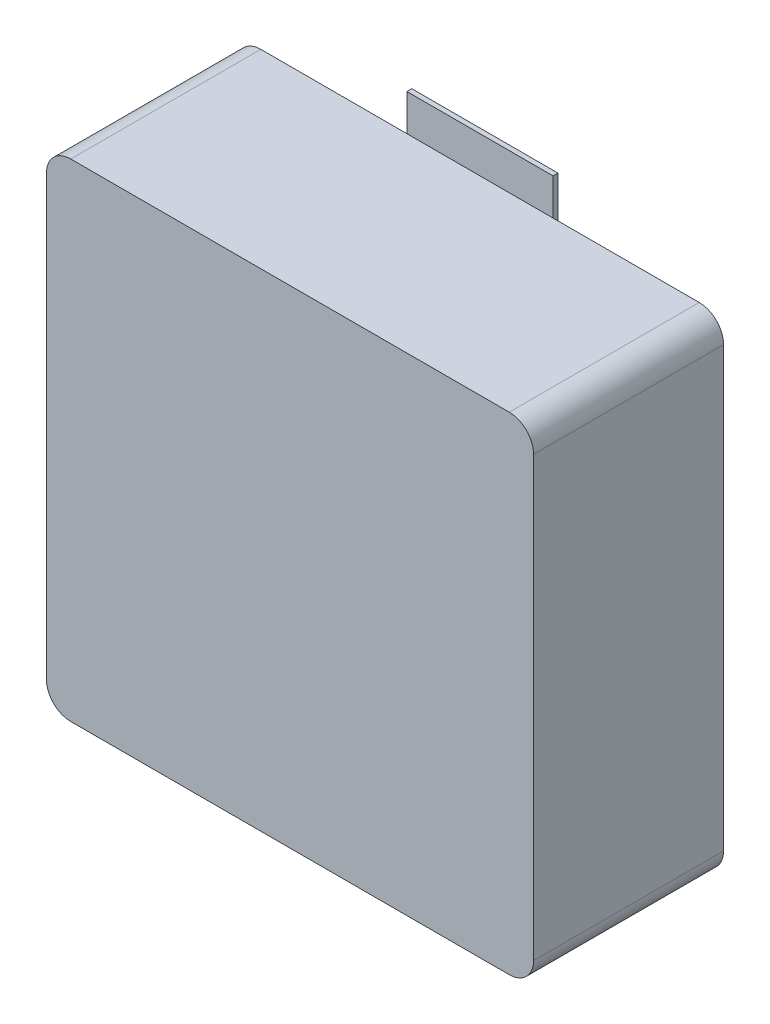
ISO-10303-21;
HEADER;
FILE_DESCRIPTION(('STEP AP214'),'2;1');
FILE_NAME('part.step','',(''),(''),'','','');
FILE_SCHEMA(('AUTOMOTIVE_DESIGN { 1 0 10303 214 1 1 1 1 }'));
ENDSEC;
DATA;
#1=APPLICATION_CONTEXT('core data for automotive mechanical design processes');
#2=APPLICATION_PROTOCOL_DEFINITION('international standard','automotive_design',2000,#1);
#3=PRODUCT_CONTEXT('',#1,'mechanical');
#4=PRODUCT('Part','Part','',(#3));
#5=PRODUCT_RELATED_PRODUCT_CATEGORY('part','',(#4));
#6=PRODUCT_DEFINITION_FORMATION('','',#4);
#7=PRODUCT_DEFINITION_CONTEXT('part definition',#1,'design');
#8=PRODUCT_DEFINITION('design','',#6,#7);
#9=PRODUCT_DEFINITION_SHAPE('','',#8);
#10=(LENGTH_UNIT() NAMED_UNIT(*) SI_UNIT(.MILLI.,.METRE.));
#11=(NAMED_UNIT(*) PLANE_ANGLE_UNIT() SI_UNIT($,.RADIAN.));
#12=(NAMED_UNIT(*) SI_UNIT($,.STERADIAN.) SOLID_ANGLE_UNIT());
#13=UNCERTAINTY_MEASURE_WITH_UNIT(LENGTH_MEASURE(1.E-05),#10,'distance_accuracy_value','');
#14=(GEOMETRIC_REPRESENTATION_CONTEXT(3) GLOBAL_UNCERTAINTY_ASSIGNED_CONTEXT((#13)) GLOBAL_UNIT_ASSIGNED_CONTEXT((#10,
#11,#12)) REPRESENTATION_CONTEXT('',''));
#15=CARTESIAN_POINT('',(0.,0.,0.));
#16=DIRECTION('',(0.,0.,1.));
#17=DIRECTION('',(1.,0.,0.));
#18=AXIS2_PLACEMENT_3D('',#15,#16,#17);
#19=CARTESIAN_POINT('',(0.,0.,0.));
#20=DIRECTION('',(0.,0.,-1.));
#21=DIRECTION('',(0.,-1.,0.));
#22=AXIS2_PLACEMENT_3D('',#19,#20,#21);
#23=PLANE('',#22);
#24=DIRECTION('',(-1.,0.,0.));
#25=VECTOR('',#24,1.);
#26=CARTESIAN_POINT('',(0.,5.,0.));
#27=LINE('',#26,#25);
#28=CARTESIAN_POINT('',(1.5,5.,0.));
#29=VERTEX_POINT('',#28);
#30=CARTESIAN_POINT('',(-1.5,5.,0.));
#31=VERTEX_POINT('',#30);
#32=EDGE_CURVE('E202',#29,#31,#27,.T.);
#33=ORIENTED_EDGE('',*,*,#32,.F.);
#34=DIRECTION('',(0.,-1.,0.));
#35=VECTOR('',#34,1.);
#36=CARTESIAN_POINT('',(1.5,4.75,0.));
#37=LINE('',#36,#35);
#38=CARTESIAN_POINT('',(1.5,5.75,0.));
#39=VERTEX_POINT('',#38);
#40=EDGE_CURVE('E391',#39,#29,#37,.T.);
#41=ORIENTED_EDGE('',*,*,#40,.F.);
#42=DIRECTION('',(-1.,0.,0.));
#43=VECTOR('',#42,1.);
#44=CARTESIAN_POINT('',(0.,5.75,0.));
#45=LINE('',#44,#43);
#46=CARTESIAN_POINT('',(-1.5,5.75,0.));
#47=VERTEX_POINT('',#46);
#48=EDGE_CURVE('E205',#39,#47,#45,.T.);
#49=ORIENTED_EDGE('',*,*,#48,.T.);
#50=DIRECTION('',(0.,-1.,0.));
#51=VECTOR('',#50,1.);
#52=CARTESIAN_POINT('',(-1.5,4.75,0.));
#53=LINE('',#52,#51);
#54=EDGE_CURVE('E28',#47,#31,#53,.T.);
#55=ORIENTED_EDGE('',*,*,#54,.T.);
#56=EDGE_LOOP('',(#33,#41,#49,#55));
#57=FACE_BOUND('',#56,.T.);
#58=ADVANCED_FACE('F17',(#57),#23,.F.);
#59=CARTESIAN_POINT('',(0.,0.,-0.1));
#60=DIRECTION('',(0.,0.,-1.));
#61=DIRECTION('',(0.,-1.,0.));
#62=AXIS2_PLACEMENT_3D('',#59,#60,#61);
#63=PLANE('',#62);
#64=DIRECTION('',(-1.,0.,0.));
#65=VECTOR('',#64,1.);
#66=CARTESIAN_POINT('',(0.,5.75,-0.1));
#67=LINE('',#66,#65);
#68=CARTESIAN_POINT('',(1.5,5.75,-0.1));
#69=VERTEX_POINT('',#68);
#70=CARTESIAN_POINT('',(-1.5,5.75,-0.1));
#71=VERTEX_POINT('',#70);
#72=EDGE_CURVE('E286',#69,#71,#67,.T.);
#73=ORIENTED_EDGE('',*,*,#72,.F.);
#74=DIRECTION('',(0.,-1.,0.));
#75=VECTOR('',#74,1.);
#76=CARTESIAN_POINT('',(1.5,4.75,-0.1));
#77=LINE('',#76,#75);
#78=CARTESIAN_POINT('',(1.5,3.75,-0.1));
#79=VERTEX_POINT('',#78);
#80=EDGE_CURVE('E309',#69,#79,#77,.T.);
#81=ORIENTED_EDGE('',*,*,#80,.T.);
#82=DIRECTION('',(-1.,0.,0.));
#83=VECTOR('',#82,1.);
#84=CARTESIAN_POINT('',(0.,3.75,-0.1));
#85=LINE('',#84,#83);
#86=CARTESIAN_POINT('',(-1.5,3.75,-0.1));
#87=VERTEX_POINT('',#86);
#88=EDGE_CURVE('E21',#79,#87,#85,.T.);
#89=ORIENTED_EDGE('',*,*,#88,.T.);
#90=DIRECTION('',(0.,-1.,0.));
#91=VECTOR('',#90,1.);
#92=CARTESIAN_POINT('',(-1.5,4.75,-0.1));
#93=LINE('',#92,#91);
#94=EDGE_CURVE('E11',#71,#87,#93,.T.);
#95=ORIENTED_EDGE('',*,*,#94,.F.);
#96=EDGE_LOOP('',(#73,#81,#89,#95));
#97=FACE_BOUND('',#96,.T.);
#98=ADVANCED_FACE('F454',(#97),#63,.T.);
#99=CARTESIAN_POINT('',(-1.5,4.75,-0.1));
#100=DIRECTION('',(-1.,0.,0.));
#101=DIRECTION('',(0.,1.,0.));
#102=AXIS2_PLACEMENT_3D('',#99,#100,#101);
#103=PLANE('',#102);
#104=ORIENTED_EDGE('',*,*,#54,.F.);
#105=DIRECTION('',(0.,0.,1.));
#106=VECTOR('',#105,1.);
#107=CARTESIAN_POINT('',(-1.5,5.75,-0.1));
#108=LINE('',#107,#106);
#109=EDGE_CURVE('E289',#71,#47,#108,.T.);
#110=ORIENTED_EDGE('',*,*,#109,.F.);
#111=ORIENTED_EDGE('',*,*,#94,.T.);
#112=DIRECTION('',(0.,0.,1.));
#113=VECTOR('',#112,1.);
#114=CARTESIAN_POINT('',(-1.5,3.75,-0.1));
#115=LINE('',#114,#113);
#116=CARTESIAN_POINT('',(-1.5,3.75,0.));
#117=VERTEX_POINT('',#116);
#118=EDGE_CURVE('E214',#87,#117,#115,.T.);
#119=ORIENTED_EDGE('',*,*,#118,.T.);
#120=DIRECTION('',(0.,-1.,0.));
#121=VECTOR('',#120,1.);
#122=CARTESIAN_POINT('',(-1.5,4.75,0.));
#123=LINE('',#122,#121);
#124=EDGE_CURVE('E210',#31,#117,#123,.T.);
#125=ORIENTED_EDGE('',*,*,#124,.F.);
#126=EDGE_LOOP('',(#104,#110,#111,#119,#125));
#127=FACE_BOUND('',#126,.T.);
#128=ADVANCED_FACE('F212',(#127),#103,.T.);
#129=CARTESIAN_POINT('',(0.,3.75,-0.1));
#130=DIRECTION('',(0.,1.,0.));
#131=DIRECTION('',(1.,0.,0.));
#132=AXIS2_PLACEMENT_3D('',#129,#130,#131);
#133=PLANE('',#132);
#134=DIRECTION('',(-1.,0.,0.));
#135=VECTOR('',#134,1.);
#136=CARTESIAN_POINT('',(0.,3.75,0.));
#137=LINE('',#136,#135);
#138=CARTESIAN_POINT('',(1.5,3.75,0.));
#139=VERTEX_POINT('',#138);
#140=EDGE_CURVE('E219',#139,#117,#137,.T.);
#141=ORIENTED_EDGE('',*,*,#140,.T.);
#142=ORIENTED_EDGE('',*,*,#118,.F.);
#143=ORIENTED_EDGE('',*,*,#88,.F.);
#144=DIRECTION('',(0.,0.,1.));
#145=VECTOR('',#144,1.);
#146=CARTESIAN_POINT('',(1.5,3.75,-0.1));
#147=LINE('',#146,#145);
#148=EDGE_CURVE('E313',#79,#139,#147,.T.);
#149=ORIENTED_EDGE('',*,*,#148,.T.);
#150=EDGE_LOOP('',(#141,#142,#143,#149));
#151=FACE_BOUND('',#150,.T.);
#152=ADVANCED_FACE('F457',(#151),#133,.F.);
#153=CARTESIAN_POINT('',(1.5,4.75,-0.1));
#154=DIRECTION('',(-1.,0.,0.));
#155=DIRECTION('',(0.,1.,0.));
#156=AXIS2_PLACEMENT_3D('',#153,#154,#155);
#157=PLANE('',#156);
#158=ORIENTED_EDGE('',*,*,#40,.T.);
#159=DIRECTION('',(0.,-1.,0.));
#160=VECTOR('',#159,1.);
#161=CARTESIAN_POINT('',(1.5,4.75,0.));
#162=LINE('',#161,#160);
#163=EDGE_CURVE('E373',#29,#139,#162,.T.);
#164=ORIENTED_EDGE('',*,*,#163,.T.);
#165=ORIENTED_EDGE('',*,*,#148,.F.);
#166=ORIENTED_EDGE('',*,*,#80,.F.);
#167=DIRECTION('',(0.,0.,1.));
#168=VECTOR('',#167,1.);
#169=CARTESIAN_POINT('',(1.5,5.75,-0.1));
#170=LINE('',#169,#168);
#171=EDGE_CURVE('E277',#69,#39,#170,.T.);
#172=ORIENTED_EDGE('',*,*,#171,.T.);
#173=EDGE_LOOP('',(#158,#164,#165,#166,#172));
#174=FACE_BOUND('',#173,.T.);
#175=ADVANCED_FACE('F465',(#174),#157,.F.);
#176=CARTESIAN_POINT('',(0.,5.75,-0.1));
#177=DIRECTION('',(0.,1.,0.));
#178=DIRECTION('',(1.,0.,0.));
#179=AXIS2_PLACEMENT_3D('',#176,#177,#178);
#180=PLANE('',#179);
#181=ORIENTED_EDGE('',*,*,#48,.F.);
#182=ORIENTED_EDGE('',*,*,#171,.F.);
#183=ORIENTED_EDGE('',*,*,#72,.T.);
#184=ORIENTED_EDGE('',*,*,#109,.T.);
#185=EDGE_LOOP('',(#181,#182,#183,#184));
#186=FACE_BOUND('',#185,.T.);
#187=ADVANCED_FACE('F449',(#186),#180,.T.);
#188=CARTESIAN_POINT('',(0.,0.,-0.1));
#189=DIRECTION('',(0.,0.,-1.));
#190=DIRECTION('',(0.,-1.,0.));
#191=AXIS2_PLACEMENT_3D('',#188,#189,#190);
#192=PLANE('',#191);
#193=DIRECTION('',(-1.,0.,0.));
#194=VECTOR('',#193,1.);
#195=CARTESIAN_POINT('',(0.,-3.75,-0.1));
#196=LINE('',#195,#194);
#197=CARTESIAN_POINT('',(1.5,-3.75,-0.1));
#198=VERTEX_POINT('',#197);
#199=CARTESIAN_POINT('',(-1.5,-3.75,-0.1));
#200=VERTEX_POINT('',#199);
#201=EDGE_CURVE('E255',#198,#200,#196,.T.);
#202=ORIENTED_EDGE('',*,*,#201,.F.);
#203=DIRECTION('',(0.,-1.,0.));
#204=VECTOR('',#203,1.);
#205=CARTESIAN_POINT('',(1.5,-4.75,-0.1));
#206=LINE('',#205,#204);
#207=CARTESIAN_POINT('',(1.5,-5.75,-0.1));
#208=VERTEX_POINT('',#207);
#209=EDGE_CURVE('E264',#198,#208,#206,.T.);
#210=ORIENTED_EDGE('',*,*,#209,.T.);
#211=DIRECTION('',(-1.,0.,0.));
#212=VECTOR('',#211,1.);
#213=CARTESIAN_POINT('',(0.,-5.75,-0.1));
#214=LINE('',#213,#212);
#215=CARTESIAN_POINT('',(-1.5,-5.75,-0.1));
#216=VERTEX_POINT('',#215);
#217=EDGE_CURVE('E352',#208,#216,#214,.T.);
#218=ORIENTED_EDGE('',*,*,#217,.T.);
#219=DIRECTION('',(0.,-1.,0.));
#220=VECTOR('',#219,1.);
#221=CARTESIAN_POINT('',(-1.5,-4.75,-0.1));
#222=LINE('',#221,#220);
#223=EDGE_CURVE('E357',#200,#216,#222,.T.);
#224=ORIENTED_EDGE('',*,*,#223,.F.);
#225=EDGE_LOOP('',(#202,#210,#218,#224));
#226=FACE_BOUND('',#225,.T.);
#227=ADVANCED_FACE('F475',(#226),#192,.T.);
#228=CARTESIAN_POINT('',(-1.5,-4.75,-0.1));
#229=DIRECTION('',(-1.,0.,0.));
#230=DIRECTION('',(0.,0.,1.));
#231=AXIS2_PLACEMENT_3D('',#228,#229,#230);
#232=PLANE('',#231);
#233=DIRECTION('',(0.,-1.,0.));
#234=VECTOR('',#233,1.);
#235=CARTESIAN_POINT('',(-1.5,-4.75,0.));
#236=LINE('',#235,#234);
#237=CARTESIAN_POINT('',(-1.5,-3.75,0.));
#238=VERTEX_POINT('',#237);
#239=CARTESIAN_POINT('',(-1.5,-5.,0.));
#240=VERTEX_POINT('',#239);
#241=EDGE_CURVE('E220',#238,#240,#236,.T.);
#242=ORIENTED_EDGE('',*,*,#241,.F.);
#243=DIRECTION('',(0.,0.,1.));
#244=VECTOR('',#243,1.);
#245=CARTESIAN_POINT('',(-1.5,-3.75,-0.1));
#246=LINE('',#245,#244);
#247=EDGE_CURVE('E253',#200,#238,#246,.T.);
#248=ORIENTED_EDGE('',*,*,#247,.F.);
#249=ORIENTED_EDGE('',*,*,#223,.T.);
#250=DIRECTION('',(0.,0.,1.));
#251=VECTOR('',#250,1.);
#252=CARTESIAN_POINT('',(-1.5,-5.75,-0.1));
#253=LINE('',#252,#251);
#254=CARTESIAN_POINT('',(-1.5,-5.75,0.));
#255=VERTEX_POINT('',#254);
#256=EDGE_CURVE('E189',#216,#255,#253,.T.);
#257=ORIENTED_EDGE('',*,*,#256,.T.);
#258=DIRECTION('',(0.,-1.,0.));
#259=VECTOR('',#258,1.);
#260=CARTESIAN_POINT('',(-1.5,-4.75,0.));
#261=LINE('',#260,#259);
#262=EDGE_CURVE('E328',#240,#255,#261,.T.);
#263=ORIENTED_EDGE('',*,*,#262,.F.);
#264=EDGE_LOOP('',(#242,#248,#249,#257,#263));
#265=FACE_BOUND('',#264,.T.);
#266=ADVANCED_FACE('F497',(#265),#232,.T.);
#267=CARTESIAN_POINT('',(0.,-5.75,-0.1));
#268=DIRECTION('',(0.,1.,0.));
#269=DIRECTION('',(1.,0.,0.));
#270=AXIS2_PLACEMENT_3D('',#267,#268,#269);
#271=PLANE('',#270);
#272=DIRECTION('',(-1.,0.,0.));
#273=VECTOR('',#272,1.);
#274=CARTESIAN_POINT('',(0.,-5.75,0.));
#275=LINE('',#274,#273);
#276=CARTESIAN_POINT('',(1.5,-5.75,0.));
#277=VERTEX_POINT('',#276);
#278=EDGE_CURVE('E274',#277,#255,#275,.T.);
#279=ORIENTED_EDGE('',*,*,#278,.T.);
#280=ORIENTED_EDGE('',*,*,#256,.F.);
#281=ORIENTED_EDGE('',*,*,#217,.F.);
#282=DIRECTION('',(0.,0.,1.));
#283=VECTOR('',#282,1.);
#284=CARTESIAN_POINT('',(1.5,-5.75,-0.1));
#285=LINE('',#284,#283);
#286=EDGE_CURVE('E179',#208,#277,#285,.T.);
#287=ORIENTED_EDGE('',*,*,#286,.T.);
#288=EDGE_LOOP('',(#279,#280,#281,#287));
#289=FACE_BOUND('',#288,.T.);
#290=ADVANCED_FACE('F496',(#289),#271,.F.);
#291=CARTESIAN_POINT('',(1.5,-4.75,-0.1));
#292=DIRECTION('',(-1.,0.,0.));
#293=DIRECTION('',(0.,0.,1.));
#294=AXIS2_PLACEMENT_3D('',#291,#292,#293);
#295=PLANE('',#294);
#296=DIRECTION('',(0.,-1.,0.));
#297=VECTOR('',#296,1.);
#298=CARTESIAN_POINT('',(1.5,-4.75,0.));
#299=LINE('',#298,#297);
#300=CARTESIAN_POINT('',(1.5,-3.75,0.));
#301=VERTEX_POINT('',#300);
#302=CARTESIAN_POINT('',(1.5,-5.,0.));
#303=VERTEX_POINT('',#302);
#304=EDGE_CURVE('E317',#301,#303,#299,.T.);
#305=ORIENTED_EDGE('',*,*,#304,.T.);
#306=DIRECTION('',(0.,-1.,0.));
#307=VECTOR('',#306,1.);
#308=CARTESIAN_POINT('',(1.5,-4.75,0.));
#309=LINE('',#308,#307);
#310=EDGE_CURVE('E331',#303,#277,#309,.T.);
#311=ORIENTED_EDGE('',*,*,#310,.T.);
#312=ORIENTED_EDGE('',*,*,#286,.F.);
#313=ORIENTED_EDGE('',*,*,#209,.F.);
#314=DIRECTION('',(0.,0.,1.));
#315=VECTOR('',#314,1.);
#316=CARTESIAN_POINT('',(1.5,-3.75,-0.1));
#317=LINE('',#316,#315);
#318=EDGE_CURVE('E267',#198,#301,#317,.T.);
#319=ORIENTED_EDGE('',*,*,#318,.T.);
#320=EDGE_LOOP('',(#305,#311,#312,#313,#319));
#321=FACE_BOUND('',#320,.T.);
#322=ADVANCED_FACE('F493',(#321),#295,.F.);
#323=CARTESIAN_POINT('',(0.,-3.75,-0.1));
#324=DIRECTION('',(0.,1.,0.));
#325=DIRECTION('',(1.,0.,0.));
#326=AXIS2_PLACEMENT_3D('',#323,#324,#325);
#327=PLANE('',#326);
#328=DIRECTION('',(-1.,0.,0.));
#329=VECTOR('',#328,1.);
#330=CARTESIAN_POINT('',(0.,-3.75,0.));
#331=LINE('',#330,#329);
#332=EDGE_CURVE('E306',#301,#238,#331,.T.);
#333=ORIENTED_EDGE('',*,*,#332,.F.);
#334=ORIENTED_EDGE('',*,*,#318,.F.);
#335=ORIENTED_EDGE('',*,*,#201,.T.);
#336=ORIENTED_EDGE('',*,*,#247,.T.);
#337=EDGE_LOOP('',(#333,#334,#335,#336));
#338=FACE_BOUND('',#337,.T.);
#339=ADVANCED_FACE('F495',(#338),#327,.T.);
#340=CARTESIAN_POINT('',(0.,0.,0.));
#341=DIRECTION('',(0.,0.,-1.));
#342=DIRECTION('',(0.,-1.,0.));
#343=AXIS2_PLACEMENT_3D('',#340,#341,#342);
#344=PLANE('',#343);
#345=ORIENTED_EDGE('',*,*,#310,.F.);
#346=DIRECTION('',(-1.,0.,0.));
#347=VECTOR('',#346,1.);
#348=CARTESIAN_POINT('',(0.,-5.,0.));
#349=LINE('',#348,#347);
#350=EDGE_CURVE('E247',#303,#240,#349,.T.);
#351=ORIENTED_EDGE('',*,*,#350,.T.);
#352=ORIENTED_EDGE('',*,*,#262,.T.);
#353=ORIENTED_EDGE('',*,*,#278,.F.);
#354=EDGE_LOOP('',(#345,#351,#352,#353));
#355=FACE_BOUND('',#354,.T.);
#356=ADVANCED_FACE('F19',(#355),#344,.F.);
#357=CARTESIAN_POINT('',(0.,0.,0.));
#358=DIRECTION('',(0.,0.,1.));
#359=DIRECTION('',(1.,0.,0.));
#360=AXIS2_PLACEMENT_3D('',#357,#358,#359);
#361=PLANE('',#360);
#362=DIRECTION('',(0.,1.,0.));
#363=VECTOR('',#362,1.);
#364=CARTESIAN_POINT('',(5.,0.,0.));
#365=LINE('',#364,#363);
#366=CARTESIAN_POINT('',(5.,-4.5,0.));
#367=VERTEX_POINT('',#366);
#368=CARTESIAN_POINT('',(5.,4.5,0.));
#369=VERTEX_POINT('',#368);
#370=EDGE_CURVE('E229',#367,#369,#365,.T.);
#371=ORIENTED_EDGE('',*,*,#370,.F.);
#372=CARTESIAN_POINT('',(4.5,-4.5,0.));
#373=DIRECTION('',(0.,0.,-1.));
#374=DIRECTION('',(1.,0.,0.));
#375=AXIS2_PLACEMENT_3D('',#372,#373,#374);
#376=CIRCLE('',#375,0.5);
#377=CARTESIAN_POINT('',(4.5,-5.,0.));
#378=VERTEX_POINT('',#377);
#379=EDGE_CURVE('E284',#367,#378,#376,.T.);
#380=ORIENTED_EDGE('',*,*,#379,.T.);
#381=DIRECTION('',(-1.,0.,0.));
#382=VECTOR('',#381,1.);
#383=CARTESIAN_POINT('',(0.,-5.,0.));
#384=LINE('',#383,#382);
#385=EDGE_CURVE('E295',#378,#303,#384,.T.);
#386=ORIENTED_EDGE('',*,*,#385,.T.);
#387=ORIENTED_EDGE('',*,*,#304,.F.);
#388=ORIENTED_EDGE('',*,*,#332,.T.);
#389=ORIENTED_EDGE('',*,*,#241,.T.);
#390=DIRECTION('',(-1.,0.,0.));
#391=VECTOR('',#390,1.);
#392=CARTESIAN_POINT('',(0.,-5.,0.));
#393=LINE('',#392,#391);
#394=CARTESIAN_POINT('',(-4.5,-5.,0.));
#395=VERTEX_POINT('',#394);
#396=EDGE_CURVE('E245',#240,#395,#393,.T.);
#397=ORIENTED_EDGE('',*,*,#396,.T.);
#398=CARTESIAN_POINT('',(-4.5,-4.5,0.));
#399=DIRECTION('',(0.,0.,-1.));
#400=DIRECTION('',(1.,0.,0.));
#401=AXIS2_PLACEMENT_3D('',#398,#399,#400);
#402=CIRCLE('',#401,0.5);
#403=CARTESIAN_POINT('',(-5.,-4.5,0.));
#404=VERTEX_POINT('',#403);
#405=EDGE_CURVE('E249',#395,#404,#402,.T.);
#406=ORIENTED_EDGE('',*,*,#405,.T.);
#407=DIRECTION('',(0.,1.,0.));
#408=VECTOR('',#407,1.);
#409=CARTESIAN_POINT('',(-5.,0.,0.));
#410=LINE('',#409,#408);
#411=CARTESIAN_POINT('',(-5.,4.5,0.));
#412=VERTEX_POINT('',#411);
#413=EDGE_CURVE('E314',#404,#412,#410,.T.);
#414=ORIENTED_EDGE('',*,*,#413,.T.);
#415=CARTESIAN_POINT('',(-4.5,4.5,0.));
#416=DIRECTION('',(0.,0.,-1.));
#417=DIRECTION('',(1.,0.,0.));
#418=AXIS2_PLACEMENT_3D('',#415,#416,#417);
#419=CIRCLE('',#418,0.5);
#420=CARTESIAN_POINT('',(-4.5,5.,0.));
#421=VERTEX_POINT('',#420);
#422=EDGE_CURVE('E226',#412,#421,#419,.T.);
#423=ORIENTED_EDGE('',*,*,#422,.T.);
#424=DIRECTION('',(-1.,0.,0.));
#425=VECTOR('',#424,1.);
#426=CARTESIAN_POINT('',(0.,5.,0.));
#427=LINE('',#426,#425);
#428=EDGE_CURVE('E223',#31,#421,#427,.T.);
#429=ORIENTED_EDGE('',*,*,#428,.F.);
#430=ORIENTED_EDGE('',*,*,#124,.T.);
#431=ORIENTED_EDGE('',*,*,#140,.F.);
#432=ORIENTED_EDGE('',*,*,#163,.F.);
#433=DIRECTION('',(-1.,0.,0.));
#434=VECTOR('',#433,1.);
#435=CARTESIAN_POINT('',(0.,5.,0.));
#436=LINE('',#435,#434);
#437=CARTESIAN_POINT('',(4.5,5.,0.));
#438=VERTEX_POINT('',#437);
#439=EDGE_CURVE('E232',#438,#29,#436,.T.);
#440=ORIENTED_EDGE('',*,*,#439,.F.);
#441=CARTESIAN_POINT('',(4.5,4.5,0.));
#442=DIRECTION('',(0.,0.,-1.));
#443=DIRECTION('',(1.,0.,0.));
#444=AXIS2_PLACEMENT_3D('',#441,#442,#443);
#445=CIRCLE('',#444,0.5);
#446=EDGE_CURVE('E318',#438,#369,#445,.T.);
#447=ORIENTED_EDGE('',*,*,#446,.T.);
#448=EDGE_LOOP('',(#371,#380,#386,#387,#388,#389,#397,#406,#414,#423,#429,#430,#431,#432,#440,#447));
#449=FACE_BOUND('',#448,.T.);
#450=ADVANCED_FACE('F224',(#449),#361,.F.);
#451=CARTESIAN_POINT('',(-5.,0.,3.9));
#452=DIRECTION('',(-1.,0.,0.));
#453=DIRECTION('',(0.,0.,1.));
#454=AXIS2_PLACEMENT_3D('',#451,#452,#453);
#455=PLANE('',#454);
#456=DIRECTION('',(0.,1.,0.));
#457=VECTOR('',#456,1.);
#458=CARTESIAN_POINT('',(-5.,0.,3.9));
#459=LINE('',#458,#457);
#460=CARTESIAN_POINT('',(-5.,-4.5,3.9));
#461=VERTEX_POINT('',#460);
#462=CARTESIAN_POINT('',(-5.,4.5,3.9));
#463=VERTEX_POINT('',#462);
#464=EDGE_CURVE('E239',#461,#463,#459,.T.);
#465=ORIENTED_EDGE('',*,*,#464,.T.);
#466=DIRECTION('',(0.,0.,-1.));
#467=VECTOR('',#466,1.);
#468=CARTESIAN_POINT('',(-5.,4.5,0.));
#469=LINE('',#468,#467);
#470=EDGE_CURVE('E299',#463,#412,#469,.T.);
#471=ORIENTED_EDGE('',*,*,#470,.T.);
#472=ORIENTED_EDGE('',*,*,#413,.F.);
#473=DIRECTION('',(0.,0.,1.));
#474=VECTOR('',#473,1.);
#475=CARTESIAN_POINT('',(-5.,-4.5,3.9));
#476=LINE('',#475,#474);
#477=EDGE_CURVE('E243',#404,#461,#476,.T.);
#478=ORIENTED_EDGE('',*,*,#477,.T.);
#479=EDGE_LOOP('',(#465,#471,#472,#478));
#480=FACE_BOUND('',#479,.T.);
#481=ADVANCED_FACE('F491',(#480),#455,.T.);
#482=CARTESIAN_POINT('',(5.,0.,3.9));
#483=DIRECTION('',(-1.,0.,0.));
#484=DIRECTION('',(0.,0.,1.));
#485=AXIS2_PLACEMENT_3D('',#482,#483,#484);
#486=PLANE('',#485);
#487=DIRECTION('',(0.,1.,0.));
#488=VECTOR('',#487,1.);
#489=CARTESIAN_POINT('',(5.,0.,3.9));
#490=LINE('',#489,#488);
#491=CARTESIAN_POINT('',(5.,-4.5,3.9));
#492=VERTEX_POINT('',#491);
#493=CARTESIAN_POINT('',(5.,4.5,3.9));
#494=VERTEX_POINT('',#493);
#495=EDGE_CURVE('E160',#492,#494,#490,.T.);
#496=ORIENTED_EDGE('',*,*,#495,.F.);
#497=DIRECTION('',(0.,0.,-1.));
#498=VECTOR('',#497,1.);
#499=CARTESIAN_POINT('',(5.,-4.5,0.));
#500=LINE('',#499,#498);
#501=EDGE_CURVE('E327',#492,#367,#500,.T.);
#502=ORIENTED_EDGE('',*,*,#501,.T.);
#503=ORIENTED_EDGE('',*,*,#370,.T.);
#504=DIRECTION('',(0.,0.,1.));
#505=VECTOR('',#504,1.);
#506=CARTESIAN_POINT('',(5.,4.5,3.9));
#507=LINE('',#506,#505);
#508=EDGE_CURVE('E322',#369,#494,#507,.T.);
#509=ORIENTED_EDGE('',*,*,#508,.T.);
#510=EDGE_LOOP('',(#496,#502,#503,#509));
#511=FACE_BOUND('',#510,.T.);
#512=ADVANCED_FACE('F398',(#511),#486,.F.);
#513=CARTESIAN_POINT('',(0.,5.,3.9));
#514=DIRECTION('',(0.,-1.,0.));
#515=DIRECTION('',(0.,0.,-1.));
#516=AXIS2_PLACEMENT_3D('',#513,#514,#515);
#517=PLANE('',#516);
#518=DIRECTION('',(-1.,0.,0.));
#519=VECTOR('',#518,1.);
#520=CARTESIAN_POINT('',(0.,5.,3.9));
#521=LINE('',#520,#519);
#522=CARTESIAN_POINT('',(4.5,5.,3.9));
#523=VERTEX_POINT('',#522);
#524=CARTESIAN_POINT('',(-4.5,5.,3.9));
#525=VERTEX_POINT('',#524);
#526=EDGE_CURVE('E149',#523,#525,#521,.T.);
#527=ORIENTED_EDGE('',*,*,#526,.F.);
#528=DIRECTION('',(0.,0.,-1.));
#529=VECTOR('',#528,1.);
#530=CARTESIAN_POINT('',(4.5,5.,3.9));
#531=LINE('',#530,#529);
#532=EDGE_CURVE('E321',#523,#438,#531,.T.);
#533=ORIENTED_EDGE('',*,*,#532,.T.);
#534=ORIENTED_EDGE('',*,*,#439,.T.);
#535=ORIENTED_EDGE('',*,*,#32,.T.);
#536=ORIENTED_EDGE('',*,*,#428,.T.);
#537=DIRECTION('',(0.,0.,1.));
#538=VECTOR('',#537,1.);
#539=CARTESIAN_POINT('',(-4.5,5.,3.9));
#540=LINE('',#539,#538);
#541=EDGE_CURVE('E291',#421,#525,#540,.T.);
#542=ORIENTED_EDGE('',*,*,#541,.T.);
#543=EDGE_LOOP('',(#527,#533,#534,#535,#536,#542));
#544=FACE_BOUND('',#543,.T.);
#545=ADVANCED_FACE('F231',(#544),#517,.F.);
#546=CARTESIAN_POINT('',(0.,0.,3.9));
#547=DIRECTION('',(0.,0.,1.));
#548=DIRECTION('',(1.,0.,0.));
#549=AXIS2_PLACEMENT_3D('',#546,#547,#548);
#550=PLANE('',#549);
#551=DIRECTION('',(-1.,0.,0.));
#552=VECTOR('',#551,1.);
#553=CARTESIAN_POINT('',(0.,-5.,3.9));
#554=LINE('',#553,#552);
#555=CARTESIAN_POINT('',(4.5,-5.,3.9));
#556=VERTEX_POINT('',#555);
#557=CARTESIAN_POINT('',(-4.5,-5.,3.9));
#558=VERTEX_POINT('',#557);
#559=EDGE_CURVE('E248',#556,#558,#554,.T.);
#560=ORIENTED_EDGE('',*,*,#559,.F.);
#561=CARTESIAN_POINT('',(4.5,-4.5,3.9));
#562=DIRECTION('',(0.,0.,1.));
#563=DIRECTION('',(1.,0.,0.));
#564=AXIS2_PLACEMENT_3D('',#561,#562,#563);
#565=CIRCLE('',#564,0.5);
#566=EDGE_CURVE('E285',#556,#492,#565,.T.);
#567=ORIENTED_EDGE('',*,*,#566,.T.);
#568=ORIENTED_EDGE('',*,*,#495,.T.);
#569=CARTESIAN_POINT('',(4.5,4.5,3.9));
#570=DIRECTION('',(0.,0.,1.));
#571=DIRECTION('',(1.,0.,0.));
#572=AXIS2_PLACEMENT_3D('',#569,#570,#571);
#573=CIRCLE('',#572,0.5);
#574=EDGE_CURVE('E335',#494,#523,#573,.T.);
#575=ORIENTED_EDGE('',*,*,#574,.T.);
#576=ORIENTED_EDGE('',*,*,#526,.T.);
#577=CARTESIAN_POINT('',(-4.5,4.5,3.9));
#578=DIRECTION('',(0.,0.,1.));
#579=DIRECTION('',(1.,0.,0.));
#580=AXIS2_PLACEMENT_3D('',#577,#578,#579);
#581=CIRCLE('',#580,0.5);
#582=EDGE_CURVE('E294',#525,#463,#581,.T.);
#583=ORIENTED_EDGE('',*,*,#582,.T.);
#584=ORIENTED_EDGE('',*,*,#464,.F.);
#585=CARTESIAN_POINT('',(-4.5,-4.5,3.9));
#586=DIRECTION('',(0.,0.,1.));
#587=DIRECTION('',(1.,0.,0.));
#588=AXIS2_PLACEMENT_3D('',#585,#586,#587);
#589=CIRCLE('',#588,0.5);
#590=EDGE_CURVE('E365',#461,#558,#589,.T.);
#591=ORIENTED_EDGE('',*,*,#590,.T.);
#592=EDGE_LOOP('',(#560,#567,#568,#575,#576,#583,#584,#591));
#593=FACE_BOUND('',#592,.T.);
#594=ADVANCED_FACE('F403',(#593),#550,.T.);
#595=CARTESIAN_POINT('',(0.,-5.,3.9));
#596=DIRECTION('',(0.,-1.,0.));
#597=DIRECTION('',(0.,0.,-1.));
#598=AXIS2_PLACEMENT_3D('',#595,#596,#597);
#599=PLANE('',#598);
#600=ORIENTED_EDGE('',*,*,#385,.F.);
#601=DIRECTION('',(0.,0.,1.));
#602=VECTOR('',#601,1.);
#603=CARTESIAN_POINT('',(4.5,-5.,3.9));
#604=LINE('',#603,#602);
#605=EDGE_CURVE('E280',#378,#556,#604,.T.);
#606=ORIENTED_EDGE('',*,*,#605,.T.);
#607=ORIENTED_EDGE('',*,*,#559,.T.);
#608=DIRECTION('',(0.,0.,-1.));
#609=VECTOR('',#608,1.);
#610=CARTESIAN_POINT('',(-4.5,-5.,3.9));
#611=LINE('',#610,#609);
#612=EDGE_CURVE('E252',#558,#395,#611,.T.);
#613=ORIENTED_EDGE('',*,*,#612,.T.);
#614=ORIENTED_EDGE('',*,*,#396,.F.);
#615=ORIENTED_EDGE('',*,*,#350,.F.);
#616=EDGE_LOOP('',(#600,#606,#607,#613,#614,#615));
#617=FACE_BOUND('',#616,.T.);
#618=ADVANCED_FACE('F428',(#617),#599,.T.);
#619=CARTESIAN_POINT('',(-4.5,4.5,3.9));
#620=DIRECTION('',(0.,0.,-1.));
#621=DIRECTION('',(1.,0.,0.));
#622=AXIS2_PLACEMENT_3D('',#619,#620,#621);
#623=CYLINDRICAL_SURFACE('',#622,0.5);
#624=ORIENTED_EDGE('',*,*,#582,.F.);
#625=ORIENTED_EDGE('',*,*,#541,.F.);
#626=ORIENTED_EDGE('',*,*,#422,.F.);
#627=ORIENTED_EDGE('',*,*,#470,.F.);
#628=EDGE_LOOP('',(#624,#625,#626,#627));
#629=FACE_BOUND('',#628,.T.);
#630=ADVANCED_FACE('F407',(#629),#623,.T.);
#631=CARTESIAN_POINT('',(4.5,4.5,3.9));
#632=DIRECTION('',(0.,0.,1.));
#633=DIRECTION('',(-1.,0.,0.));
#634=AXIS2_PLACEMENT_3D('',#631,#632,#633);
#635=CYLINDRICAL_SURFACE('',#634,0.5);
#636=ORIENTED_EDGE('',*,*,#574,.F.);
#637=ORIENTED_EDGE('',*,*,#508,.F.);
#638=ORIENTED_EDGE('',*,*,#446,.F.);
#639=ORIENTED_EDGE('',*,*,#532,.F.);
#640=EDGE_LOOP('',(#636,#637,#638,#639));
#641=FACE_BOUND('',#640,.T.);
#642=ADVANCED_FACE('F402',(#641),#635,.T.);
#643=CARTESIAN_POINT('',(-4.5,-4.5,3.9));
#644=DIRECTION('',(0.,0.,1.));
#645=DIRECTION('',(-1.,0.,0.));
#646=AXIS2_PLACEMENT_3D('',#643,#644,#645);
#647=CYLINDRICAL_SURFACE('',#646,0.5);
#648=ORIENTED_EDGE('',*,*,#590,.F.);
#649=ORIENTED_EDGE('',*,*,#477,.F.);
#650=ORIENTED_EDGE('',*,*,#405,.F.);
#651=ORIENTED_EDGE('',*,*,#612,.F.);
#652=EDGE_LOOP('',(#648,#649,#650,#651));
#653=FACE_BOUND('',#652,.T.);
#654=ADVANCED_FACE('F433',(#653),#647,.T.);
#655=CARTESIAN_POINT('',(4.5,-4.5,3.9));
#656=DIRECTION('',(0.,0.,-1.));
#657=DIRECTION('',(1.,0.,0.));
#658=AXIS2_PLACEMENT_3D('',#655,#656,#657);
#659=CYLINDRICAL_SURFACE('',#658,0.5);
#660=ORIENTED_EDGE('',*,*,#566,.F.);
#661=ORIENTED_EDGE('',*,*,#605,.F.);
#662=ORIENTED_EDGE('',*,*,#379,.F.);
#663=ORIENTED_EDGE('',*,*,#501,.F.);
#664=EDGE_LOOP('',(#660,#661,#662,#663));
#665=FACE_BOUND('',#664,.T.);
#666=ADVANCED_FACE('F440',(#665),#659,.T.);
#667=CLOSED_SHELL('',(#58,#98,#128,#152,#175,#187,#227,#266,#290,#322,#339,#356,#450,#481,#512,
#545,#594,#618,#630,#642,#654,#666));
#668=MANIFOLD_SOLID_BREP('B1',#667);
#669=ADVANCED_BREP_SHAPE_REPRESENTATION('',(#18,#668),#14);
#670=SHAPE_DEFINITION_REPRESENTATION(#9,#669);
ENDSEC;
END-ISO-10303-21;
